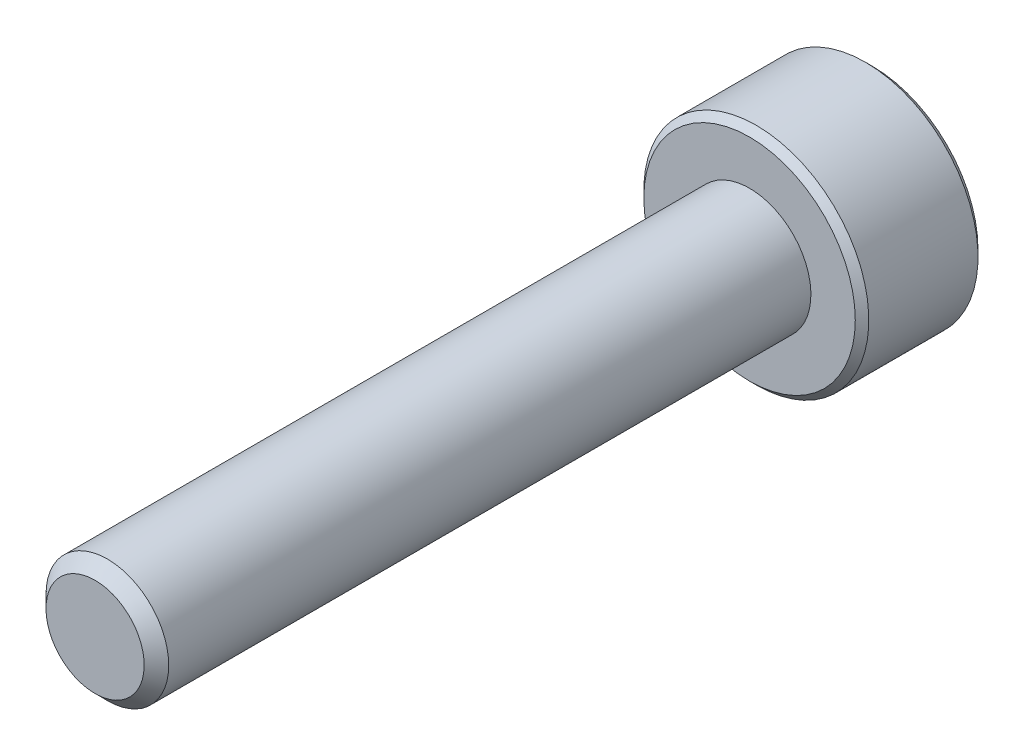
ISO-10303-21;
HEADER;
FILE_DESCRIPTION(('STEP AP214'),'2;1');
FILE_NAME('part.step','',(''),(''),'','','');
FILE_SCHEMA(('AUTOMOTIVE_DESIGN { 1 0 10303 214 1 1 1 1 }'));
ENDSEC;
DATA;
#1=APPLICATION_CONTEXT('core data for automotive mechanical design processes');
#2=APPLICATION_PROTOCOL_DEFINITION('international standard','automotive_design',2000,#1);
#3=PRODUCT_CONTEXT('',#1,'mechanical');
#4=PRODUCT('Part','Part','',(#3));
#5=PRODUCT_RELATED_PRODUCT_CATEGORY('part','',(#4));
#6=PRODUCT_DEFINITION_FORMATION('','',#4);
#7=PRODUCT_DEFINITION_CONTEXT('part definition',#1,'design');
#8=PRODUCT_DEFINITION('design','',#6,#7);
#9=PRODUCT_DEFINITION_SHAPE('','',#8);
#10=(LENGTH_UNIT() NAMED_UNIT(*) SI_UNIT(.MILLI.,.METRE.));
#11=(NAMED_UNIT(*) PLANE_ANGLE_UNIT() SI_UNIT($,.RADIAN.));
#12=(NAMED_UNIT(*) SI_UNIT($,.STERADIAN.) SOLID_ANGLE_UNIT());
#13=UNCERTAINTY_MEASURE_WITH_UNIT(LENGTH_MEASURE(1.E-05),#10,'distance_accuracy_value','');
#14=(GEOMETRIC_REPRESENTATION_CONTEXT(3) GLOBAL_UNCERTAINTY_ASSIGNED_CONTEXT((#13)) GLOBAL_UNIT_ASSIGNED_CONTEXT((#10,
#11,#12)) REPRESENTATION_CONTEXT('',''));
#15=CARTESIAN_POINT('',(0.,0.,0.));
#16=DIRECTION('',(0.,0.,1.));
#17=DIRECTION('',(1.,0.,0.));
#18=AXIS2_PLACEMENT_3D('',#15,#16,#17);
#19=CARTESIAN_POINT('',(0.,0.,-3.));
#20=DIRECTION('',(0.,0.,1.));
#21=DIRECTION('',(0.,-1.,0.));
#22=AXIS2_PLACEMENT_3D('',#19,#20,#21);
#23=PLANE('',#22);
#24=CARTESIAN_POINT('',(0.,0.,-3.));
#25=DIRECTION('',(0.,0.,1.));
#26=DIRECTION('',(0.,-1.,0.));
#27=AXIS2_PLACEMENT_3D('',#24,#25,#26);
#28=CIRCLE('',#27,2.58499999999999);
#29=CARTESIAN_POINT('',(0.,-2.58499999999999,-3.));
#30=VERTEX_POINT('',#29);
#31=EDGE_CURVE('E175',#30,#30,#28,.F.);
#32=ORIENTED_EDGE('',*,*,#31,.T.);
#33=EDGE_LOOP('',(#32));
#34=FACE_BOUND('',#33,.T.);
#35=CARTESIAN_POINT('',(0.,0.,-3.));
#36=DIRECTION('',(0.,0.,-1.));
#37=DIRECTION('',(0.,1.,0.));
#38=AXIS2_PLACEMENT_3D('',#35,#36,#37);
#39=CIRCLE('',#38,1.44337567297406);
#40=CARTESIAN_POINT('',(0.,-1.44337567297406,-3.));
#41=VERTEX_POINT('',#40);
#42=CARTESIAN_POINT('',(-1.25,-0.721687836487032,-3.));
#43=VERTEX_POINT('',#42);
#44=EDGE_CURVE('E54',#41,#43,#39,.T.);
#45=ORIENTED_EDGE('',*,*,#44,.F.);
#46=CARTESIAN_POINT('',(1.25,-0.721687836487032,-3.));
#47=VERTEX_POINT('',#46);
#48=EDGE_CURVE('E131',#47,#41,#39,.T.);
#49=ORIENTED_EDGE('',*,*,#48,.F.);
#50=CARTESIAN_POINT('',(1.25,0.721687836487033,-3.));
#51=VERTEX_POINT('',#50);
#52=EDGE_CURVE('E126',#51,#47,#39,.T.);
#53=ORIENTED_EDGE('',*,*,#52,.F.);
#54=CARTESIAN_POINT('',(0.,1.44337567297406,-3.));
#55=VERTEX_POINT('',#54);
#56=EDGE_CURVE('E95',#55,#51,#39,.T.);
#57=ORIENTED_EDGE('',*,*,#56,.F.);
#58=CARTESIAN_POINT('',(-1.25,0.721687836487035,-3.));
#59=VERTEX_POINT('',#58);
#60=EDGE_CURVE('E86',#59,#55,#39,.T.);
#61=ORIENTED_EDGE('',*,*,#60,.F.);
#62=EDGE_CURVE('E47',#43,#59,#39,.T.);
#63=ORIENTED_EDGE('',*,*,#62,.F.);
#64=EDGE_LOOP('',(#45,#49,#53,#57,#61,#63));
#65=FACE_BOUND('',#64,.T.);
#66=ADVANCED_FACE('F33',(#34,#65),#23,.F.);
#67=CARTESIAN_POINT('',(0.,0.,16.));
#68=DIRECTION('',(0.,0.,1.));
#69=DIRECTION('',(0.,-1.,0.));
#70=AXIS2_PLACEMENT_3D('',#67,#68,#69);
#71=CYLINDRICAL_SURFACE('',#70,2.75);
#72=CARTESIAN_POINT('',(0.,0.,-0.164999999999998));
#73=DIRECTION('',(0.,0.,-1.));
#74=DIRECTION('',(0.,1.,0.));
#75=AXIS2_PLACEMENT_3D('',#72,#73,#74);
#76=CIRCLE('',#75,2.75);
#77=CARTESIAN_POINT('',(0.,2.75,-0.164999999999998));
#78=VERTEX_POINT('',#77);
#79=EDGE_CURVE('E172',#78,#78,#76,.T.);
#80=ORIENTED_EDGE('',*,*,#79,.T.);
#81=EDGE_LOOP('',(#80));
#82=FACE_BOUND('',#81,.T.);
#83=CARTESIAN_POINT('',(0.,0.,-2.83499999999999));
#84=DIRECTION('',(0.,0.,1.));
#85=DIRECTION('',(0.,-1.,0.));
#86=AXIS2_PLACEMENT_3D('',#83,#84,#85);
#87=CIRCLE('',#86,2.75);
#88=CARTESIAN_POINT('',(0.,-2.75,-2.83499999999999));
#89=VERTEX_POINT('',#88);
#90=EDGE_CURVE('E169',#89,#89,#87,.T.);
#91=ORIENTED_EDGE('',*,*,#90,.T.);
#92=EDGE_LOOP('',(#91));
#93=FACE_BOUND('',#92,.T.);
#94=ADVANCED_FACE('F192',(#82,#93),#71,.T.);
#95=CARTESIAN_POINT('',(0.,2.75,0.));
#96=DIRECTION('',(0.,0.,-1.));
#97=DIRECTION('',(0.,1.,0.));
#98=AXIS2_PLACEMENT_3D('',#95,#96,#97);
#99=PLANE('',#98);
#100=CARTESIAN_POINT('',(0.,0.,0.));
#101=DIRECTION('',(0.,0.,-1.));
#102=DIRECTION('',(0.,1.,0.));
#103=AXIS2_PLACEMENT_3D('',#100,#101,#102);
#104=CIRCLE('',#103,2.585);
#105=CARTESIAN_POINT('',(0.,2.585,0.));
#106=VERTEX_POINT('',#105);
#107=EDGE_CURVE('E104',#106,#106,#104,.F.);
#108=ORIENTED_EDGE('',*,*,#107,.T.);
#109=EDGE_LOOP('',(#108));
#110=FACE_BOUND('',#109,.T.);
#111=CARTESIAN_POINT('',(0.,0.,0.));
#112=DIRECTION('',(0.,0.,1.));
#113=DIRECTION('',(0.,-1.,0.));
#114=AXIS2_PLACEMENT_3D('',#111,#112,#113);
#115=CIRCLE('',#114,1.5);
#116=CARTESIAN_POINT('',(0.,-1.5,0.));
#117=VERTEX_POINT('',#116);
#118=EDGE_CURVE('E105',#117,#117,#115,.T.);
#119=ORIENTED_EDGE('',*,*,#118,.F.);
#120=EDGE_LOOP('',(#119));
#121=FACE_BOUND('',#120,.T.);
#122=ADVANCED_FACE('F198',(#110,#121),#99,.F.);
#123=CARTESIAN_POINT('',(0.,0.,16.));
#124=DIRECTION('',(0.,0.,1.));
#125=DIRECTION('',(0.,-1.,0.));
#126=AXIS2_PLACEMENT_3D('',#123,#124,#125);
#127=CYLINDRICAL_SURFACE('',#126,1.5);
#128=CARTESIAN_POINT('',(0.,0.,15.7));
#129=DIRECTION('',(0.,0.,-1.));
#130=DIRECTION('',(0.,1.,0.));
#131=AXIS2_PLACEMENT_3D('',#128,#129,#130);
#132=CIRCLE('',#131,1.5);
#133=CARTESIAN_POINT('',(0.,1.5,15.7));
#134=VERTEX_POINT('',#133);
#135=EDGE_CURVE('E11',#134,#134,#132,.T.);
#136=ORIENTED_EDGE('',*,*,#135,.T.);
#137=EDGE_LOOP('',(#136));
#138=FACE_BOUND('',#137,.T.);
#139=ORIENTED_EDGE('',*,*,#118,.T.);
#140=EDGE_LOOP('',(#139));
#141=FACE_BOUND('',#140,.T.);
#142=ADVANCED_FACE('F215',(#138,#141),#127,.T.);
#143=CARTESIAN_POINT('',(0.,1.5,16.));
#144=DIRECTION('',(0.,0.,-1.));
#145=DIRECTION('',(0.,1.,0.));
#146=AXIS2_PLACEMENT_3D('',#143,#144,#145);
#147=PLANE('',#146);
#148=CARTESIAN_POINT('',(0.,0.,16.));
#149=DIRECTION('',(0.,0.,-1.));
#150=DIRECTION('',(0.,1.,0.));
#151=AXIS2_PLACEMENT_3D('',#148,#149,#150);
#152=CIRCLE('',#151,1.2);
#153=CARTESIAN_POINT('',(0.,1.2,16.));
#154=VERTEX_POINT('',#153);
#155=EDGE_CURVE('E41',#154,#154,#152,.F.);
#156=ORIENTED_EDGE('',*,*,#155,.T.);
#157=EDGE_LOOP('',(#156));
#158=FACE_BOUND('',#157,.T.);
#159=ADVANCED_FACE('F180',(#158),#147,.F.);
#160=CARTESIAN_POINT('',(0.,0.,-3.));
#161=DIRECTION('',(0.,0.,-1.));
#162=DIRECTION('',(0.,1.,0.));
#163=AXIS2_PLACEMENT_3D('',#160,#161,#162);
#164=CONICAL_SURFACE('',#163,1.44337567297406,0.78539816339745);
#165=ORIENTED_EDGE('',*,*,#56,.T.);
#166=CARTESIAN_POINT('',(-0.000199999999999541,1.4434911430279,-3.00011548390913));
#167=CARTESIAN_POINT('',(0.042775167071587,1.41867941875065,-2.9753216680551));
#168=CARTESIAN_POINT('',(0.0864690047459483,1.39345276980743,-2.95198373441868));
#169=CARTESIAN_POINT('',(0.175565930841942,1.34201263554194,-2.90925200408454));
#170=CARTESIAN_POINT('',(0.220977498357064,1.31579425481276,-2.88988199236041));
#171=CARTESIAN_POINT('',(0.31254782093526,1.26292610442246,-2.85670048341348));
#172=CARTESIAN_POINT('',(0.358683240175886,1.23628980770471,-2.84280555905265));
#173=CARTESIAN_POINT('',(0.451970080407592,1.18243062538508,-2.82139728216064));
#174=CARTESIAN_POINT('',(0.499118649136379,1.15520938653761,-2.81386794156679));
#175=CARTESIAN_POINT('',(0.580373556887252,1.10829684367467,-2.8070744980507));
#176=CARTESIAN_POINT('',(0.61437487662794,1.08866617256958,-2.80606855910435));
#177=CARTESIAN_POINT('',(0.682317764432477,1.04943932800611,-2.80776141491132));
#178=CARTESIAN_POINT('',(0.716259317655657,1.02984316311599,-2.81046102721554));
#179=CARTESIAN_POINT('',(0.783814856457499,0.9908399546035,-2.81940893031638));
#180=CARTESIAN_POINT('',(0.817428507286774,0.971433104248771,-2.8256605258997));
#181=CARTESIAN_POINT('',(0.884094638217813,0.932943395609906,-2.8413756814139));
#182=CARTESIAN_POINT('',(0.917146871030295,0.913860680098301,-2.85084062008746));
#183=CARTESIAN_POINT('',(1.00179969160026,0.864986351354568,-2.87893139068758));
#184=CARTESIAN_POINT('',(1.05286649242964,0.835502920149076,-2.8996701574522));
#185=CARTESIAN_POINT('',(1.15300085411325,0.777690319475909,-2.94638713467147));
#186=CARTESIAN_POINT('',(1.20207431157827,0.749357745598417,-2.97234829594676));
#187=CARTESIAN_POINT('',(1.2502,0.721572366433195,-3.00011548390913));
#188=B_SPLINE_CURVE_WITH_KNOTS('',3,(#166,#167,#168,#169,#170,#171,#172,#173,#174,#175,#176,
#177,#178,#179,#180,#181,#182,#183,#184,#185,#186,#187),.UNSPECIFIED.,.F.,.F.,(4,2,2,2,2,2,2,2,
2,2,4),(0.,0.166533409618303,0.334037607289761,0.498880396489697,0.663307919240273,
0.780963963458826,0.898645970148452,1.01643764860773,1.13427993171549,1.32148652032141,
1.50809158792573),.UNSPECIFIED.);
#189=EDGE_CURVE('E99',#55,#51,#188,.T.);
#190=ORIENTED_EDGE('',*,*,#189,.F.);
#191=EDGE_LOOP('',(#165,#190));
#192=FACE_BOUND('',#191,.T.);
#193=ADVANCED_FACE('F100',(#192),#164,.F.);
#194=ORIENTED_EDGE('',*,*,#52,.T.);
#195=CARTESIAN_POINT('',(1.25,-1.43934010829019,-3.46298209705044));
#196=CARTESIAN_POINT('',(1.25,-1.40429313026013,-3.43652492278491));
#197=CARTESIAN_POINT('',(1.25,-1.36905087155364,-3.41032716050022));
#198=CARTESIAN_POINT('',(1.25,-1.29809650724891,-3.3585575719734));
#199=CARTESIAN_POINT('',(1.25,-1.2623842859448,-3.33298590448406));
#200=CARTESIAN_POINT('',(1.25,-1.1539011180887,-3.25700599379898));
#201=CARTESIAN_POINT('',(1.25,-1.08031646741187,-3.20774028628697));
#202=CARTESIAN_POINT('',(1.25,-0.926012322877302,-3.11102583033562));
#203=CARTESIAN_POINT('',(1.25,-0.845125318763648,-3.06384129900157));
#204=CARTESIAN_POINT('',(1.25,-0.679311174153443,-2.97753073442661));
#205=CARTESIAN_POINT('',(1.25,-0.594398891087583,-2.93837753465223));
#206=CARTESIAN_POINT('',(1.25,-0.466944812509639,-2.89047722370555));
#207=CARTESIAN_POINT('',(1.25,-0.426289985866744,-2.87672948980391));
#208=CARTESIAN_POINT('',(1.25,-0.343998850155402,-2.85249792746773));
#209=CARTESIAN_POINT('',(1.25,-0.302362473684286,-2.84201432388626));
#210=CARTESIAN_POINT('',(1.25,-0.219052696365195,-2.8250301617622));
#211=CARTESIAN_POINT('',(1.25,-0.177393428559044,-2.81846136048343));
#212=CARTESIAN_POINT('',(1.25,-0.0936293694345977,-2.80943505346499));
#213=CARTESIAN_POINT('',(1.25,-0.0515246559536486,-2.80697684100151));
#214=CARTESIAN_POINT('',(1.25,0.031189057522439,-2.80635406201072));
#215=CARTESIAN_POINT('',(1.25,0.0717969624376322,-2.80803711683992));
#216=CARTESIAN_POINT('',(1.25,0.152668636765093,-2.81526827058346));
#217=CARTESIAN_POINT('',(1.25,0.192932338711554,-2.8208171103943));
#218=CARTESIAN_POINT('',(1.25,0.273499879034189,-2.83557103643701));
#219=CARTESIAN_POINT('',(1.25,0.313792180483814,-2.84483817593136));
#220=CARTESIAN_POINT('',(1.25,0.393496413769926,-2.86653617841489));
#221=CARTESIAN_POINT('',(1.25,0.432908418970283,-2.87896677668328));
#222=CARTESIAN_POINT('',(1.25,0.556992735685997,-2.92277935286094));
#223=CARTESIAN_POINT('',(1.25,0.639898924463084,-2.95915107278417));
#224=CARTESIAN_POINT('',(1.25,0.801816555245348,-3.04001916204164));
#225=CARTESIAN_POINT('',(1.25,0.880812666046053,-3.08454472075164));
#226=CARTESIAN_POINT('',(1.25,1.03178561247421,-3.17640487646102));
#227=CARTESIAN_POINT('',(1.25,1.10391618450775,-3.22348993368923));
#228=CARTESIAN_POINT('',(1.25,1.2101860600607,-3.29627856133952));
#229=CARTESIAN_POINT('',(1.25,1.24515069931176,-3.32079808512376));
#230=CARTESIAN_POINT('',(1.25,1.31460220812614,-3.37048563647493));
#231=CARTESIAN_POINT('',(1.25,1.34908920555539,-3.3956534851142));
#232=CARTESIAN_POINT('',(1.25,1.38337731640878,-3.42109014852934));
#233=B_SPLINE_CURVE_WITH_KNOTS('',3,(#195,#196,#197,#198,#199,#200,#201,#202,#203,#204,#205,
#206,#207,#208,#209,#210,#211,#212,#213,#214,#215,#216,#217,#218,#219,#220,#221,#222,#223,#224,
#225,#226,#227,#228,#229,#230,#231,#232),.UNSPECIFIED.,.F.,.F.,(4,2,2,2,2,2,2,2,2,2,2,2,2,2,2,2,
2,2,4),(0.,0.131732960406522,0.263498984211801,0.529042014557081,0.809741926293178,
1.08947609738757,1.21811634292656,1.34676544802529,1.47310084535082,1.59941451989631,
1.72115042182424,1.84290966145034,1.96679153917269,2.09066305376595,2.36146692896707,
2.63325989189267,2.89154668194565,3.01965734485811,3.14773302219539),.UNSPECIFIED.);
#234=EDGE_CURVE('E127',#51,#47,#233,.F.);
#235=ORIENTED_EDGE('',*,*,#234,.F.);
#236=EDGE_LOOP('',(#194,#235));
#237=FACE_BOUND('',#236,.T.);
#238=ADVANCED_FACE('F281',(#237),#164,.F.);
#239=ORIENTED_EDGE('',*,*,#48,.T.);
#240=CARTESIAN_POINT('',(1.2502,-0.721572366433194,-3.00011548390913));
#241=CARTESIAN_POINT('',(1.20722483292841,-0.746384090710444,-2.9753216680551));
#242=CARTESIAN_POINT('',(1.16353099525405,-0.771610739653664,-2.95198373441868));
#243=CARTESIAN_POINT('',(1.07443406915806,-0.823050873919154,-2.90925200408454));
#244=CARTESIAN_POINT('',(1.02902250164294,-0.849269254648333,-2.88988199236041));
#245=CARTESIAN_POINT('',(0.93745217906474,-0.902137405038635,-2.85670048341348));
#246=CARTESIAN_POINT('',(0.891316759824114,-0.928773701756387,-2.84280555905265));
#247=CARTESIAN_POINT('',(0.798029919592407,-0.982632884076012,-2.82139728216064));
#248=CARTESIAN_POINT('',(0.75088135086362,-1.00985412292348,-2.81386794156679));
#249=CARTESIAN_POINT('',(0.669626443112748,-1.05676666578643,-2.8070744980507));
#250=CARTESIAN_POINT('',(0.635625123372059,-1.07639733689152,-2.80606855910435));
#251=CARTESIAN_POINT('',(0.567682235567522,-1.11562418145499,-2.80776141491132));
#252=CARTESIAN_POINT('',(0.533740682344342,-1.1352203463451,-2.81046102721554));
#253=CARTESIAN_POINT('',(0.4661851435425,-1.1742235548576,-2.81940893031638));
#254=CARTESIAN_POINT('',(0.432571492713225,-1.19363040521232,-2.8256605258997));
#255=CARTESIAN_POINT('',(0.365905361782187,-1.23212011385119,-2.8413756814139));
#256=CARTESIAN_POINT('',(0.332853128969704,-1.2512028293628,-2.85084062008746));
#257=CARTESIAN_POINT('',(0.248200308399735,-1.30007715810653,-2.87893139068758));
#258=CARTESIAN_POINT('',(0.197133507570362,-1.32956058931202,-2.8996701574522));
#259=CARTESIAN_POINT('',(0.0969991458867452,-1.38737318998519,-2.94638713467147));
#260=CARTESIAN_POINT('',(0.0479256884217306,-1.41570576386268,-2.97234829594676));
#261=CARTESIAN_POINT('',(-0.000199999999999969,-1.4434911430279,-3.00011548390913));
#262=B_SPLINE_CURVE_WITH_KNOTS('',3,(#240,#241,#242,#243,#244,#245,#246,#247,#248,#249,#250,
#251,#252,#253,#254,#255,#256,#257,#258,#259,#260,#261),.UNSPECIFIED.,.F.,.F.,(4,2,2,2,2,2,2,2,
2,2,4),(0.,0.166533409618304,0.334037607289762,0.498880396489698,0.663307919240274,
0.780963963458826,0.898645970148452,1.01643764860773,1.13427993171549,1.32148652032141,
1.50809158792573),.UNSPECIFIED.);
#263=EDGE_CURVE('E129',#47,#41,#262,.T.);
#264=ORIENTED_EDGE('',*,*,#263,.F.);
#265=EDGE_LOOP('',(#239,#264));
#266=FACE_BOUND('',#265,.T.);
#267=ADVANCED_FACE('F279',(#266),#164,.F.);
#268=ORIENTED_EDGE('',*,*,#44,.T.);
#269=CARTESIAN_POINT('',(0.000200000000000132,-1.4434911430279,-3.00011548390913));
#270=CARTESIAN_POINT('',(-0.0427751670715865,-1.41867941875065,-2.9753216680551));
#271=CARTESIAN_POINT('',(-0.0864690047459478,-1.39345276980743,-2.95198373441868));
#272=CARTESIAN_POINT('',(-0.175565930841941,-1.34201263554194,-2.90925200408454));
#273=CARTESIAN_POINT('',(-0.220977498357063,-1.31579425481276,-2.88988199236041));
#274=CARTESIAN_POINT('',(-0.312547820935259,-1.26292610442246,-2.85670048341348));
#275=CARTESIAN_POINT('',(-0.358683240175885,-1.23628980770471,-2.84280555905265));
#276=CARTESIAN_POINT('',(-0.451970080407592,-1.18243062538508,-2.82139728216064));
#277=CARTESIAN_POINT('',(-0.499118649136379,-1.15520938653761,-2.81386794156679));
#278=CARTESIAN_POINT('',(-0.580373556887252,-1.10829684367467,-2.8070744980507));
#279=CARTESIAN_POINT('',(-0.61437487662794,-1.08866617256958,-2.80606855910435));
#280=CARTESIAN_POINT('',(-0.682317764432477,-1.04943932800611,-2.80776141491132));
#281=CARTESIAN_POINT('',(-0.716259317655657,-1.02984316311599,-2.81046102721554));
#282=CARTESIAN_POINT('',(-0.783814856457499,-0.990839954603499,-2.81940893031638));
#283=CARTESIAN_POINT('',(-0.817428507286774,-0.971433104248771,-2.8256605258997));
#284=CARTESIAN_POINT('',(-0.884094638217812,-0.932943395609905,-2.8413756814139));
#285=CARTESIAN_POINT('',(-0.917146871030295,-0.9138606800983,-2.85084062008746));
#286=CARTESIAN_POINT('',(-1.00179969160026,-0.864986351354567,-2.87893139068758));
#287=CARTESIAN_POINT('',(-1.05286649242964,-0.835502920149076,-2.8996701574522));
#288=CARTESIAN_POINT('',(-1.15300085411325,-0.777690319475908,-2.94638713467147));
#289=CARTESIAN_POINT('',(-1.20207431157827,-0.749357745598417,-2.97234829594676));
#290=CARTESIAN_POINT('',(-1.2502,-0.721572366433194,-3.00011548390913));
#291=B_SPLINE_CURVE_WITH_KNOTS('',3,(#269,#270,#271,#272,#273,#274,#275,#276,#277,#278,#279,
#280,#281,#282,#283,#284,#285,#286,#287,#288,#289,#290),.UNSPECIFIED.,.F.,.F.,(4,2,2,2,2,2,2,2,
2,2,4),(0.,0.166533409618303,0.334037607289761,0.498880396489698,0.663307919240274,
0.780963963458826,0.898645970148452,1.01643764860773,1.13427993171549,1.32148652032141,
1.50809158792573),.UNSPECIFIED.);
#292=EDGE_CURVE('E249',#41,#43,#291,.T.);
#293=ORIENTED_EDGE('',*,*,#292,.F.);
#294=EDGE_LOOP('',(#268,#293));
#295=FACE_BOUND('',#294,.T.);
#296=ADVANCED_FACE('F278',(#295),#164,.F.);
#297=ORIENTED_EDGE('',*,*,#62,.T.);
#298=CARTESIAN_POINT('',(-1.25,-1.43934010829019,-3.46298209705044));
#299=CARTESIAN_POINT('',(-1.25,-1.40429313026013,-3.43652492278491));
#300=CARTESIAN_POINT('',(-1.25,-1.36905087155364,-3.41032716050022));
#301=CARTESIAN_POINT('',(-1.25,-1.29809650724891,-3.3585575719734));
#302=CARTESIAN_POINT('',(-1.25,-1.2623842859448,-3.33298590448407));
#303=CARTESIAN_POINT('',(-1.25,-1.1539011180887,-3.25700599379899));
#304=CARTESIAN_POINT('',(-1.25,-1.08031646741188,-3.20774028628697));
#305=CARTESIAN_POINT('',(-1.25,-0.926012322877304,-3.11102583033562));
#306=CARTESIAN_POINT('',(-1.25,-0.84512531876365,-3.06384129900157));
#307=CARTESIAN_POINT('',(-1.25,-0.679311174153445,-2.97753073442661));
#308=CARTESIAN_POINT('',(-1.25,-0.594398891087584,-2.93837753465223));
#309=CARTESIAN_POINT('',(-1.25,-0.46694481250964,-2.89047722370555));
#310=CARTESIAN_POINT('',(-1.25,-0.426289985866745,-2.87672948980391));
#311=CARTESIAN_POINT('',(-1.25,-0.343998850155403,-2.85249792746773));
#312=CARTESIAN_POINT('',(-1.25,-0.302362473684286,-2.84201432388626));
#313=CARTESIAN_POINT('',(-1.25,-0.219052696365195,-2.8250301617622));
#314=CARTESIAN_POINT('',(-1.25,-0.177393428559044,-2.81846136048342));
#315=CARTESIAN_POINT('',(-1.25,-0.093629369434598,-2.80943505346499));
#316=CARTESIAN_POINT('',(-1.25,-0.0515246559536487,-2.80697684100151));
#317=CARTESIAN_POINT('',(-1.25,0.0311890575224389,-2.80635406201072));
#318=CARTESIAN_POINT('',(-1.25,0.0717969624376321,-2.80803711683992));
#319=CARTESIAN_POINT('',(-1.25,0.152668636765093,-2.81526827058346));
#320=CARTESIAN_POINT('',(-1.25,0.192932338711554,-2.82081711039429));
#321=CARTESIAN_POINT('',(-1.25,0.273499879034189,-2.83557103643701));
#322=CARTESIAN_POINT('',(-1.25,0.313792180483814,-2.84483817593136));
#323=CARTESIAN_POINT('',(-1.25,0.393496413769926,-2.86653617841489));
#324=CARTESIAN_POINT('',(-1.25,0.432908418970283,-2.87896677668328));
#325=CARTESIAN_POINT('',(-1.25,0.556992735685997,-2.92277935286094));
#326=CARTESIAN_POINT('',(-1.25,0.639898924463084,-2.95915107278417));
#327=CARTESIAN_POINT('',(-1.25,0.801816555245348,-3.04001916204163));
#328=CARTESIAN_POINT('',(-1.25,0.880812666046053,-3.08454472075164));
#329=CARTESIAN_POINT('',(-1.25,1.03178561247421,-3.17640487646102));
#330=CARTESIAN_POINT('',(-1.25,1.10391618450775,-3.22348993368923));
#331=CARTESIAN_POINT('',(-1.25,1.2101860600607,-3.29627856133952));
#332=CARTESIAN_POINT('',(-1.25,1.24515069931176,-3.32079808512376));
#333=CARTESIAN_POINT('',(-1.25,1.31460220812614,-3.37048563647493));
#334=CARTESIAN_POINT('',(-1.25,1.34908920555539,-3.3956534851142));
#335=CARTESIAN_POINT('',(-1.25,1.38337731640878,-3.42109014852934));
#336=B_SPLINE_CURVE_WITH_KNOTS('',3,(#298,#299,#300,#301,#302,#303,#304,#305,#306,#307,#308,
#309,#310,#311,#312,#313,#314,#315,#316,#317,#318,#319,#320,#321,#322,#323,#324,#325,#326,#327,
#328,#329,#330,#331,#332,#333,#334,#335),.UNSPECIFIED.,.F.,.F.,(4,2,2,2,2,2,2,2,2,2,2,2,2,2,2,2,
2,2,4),(0.,0.131732960406522,0.2634989842118,0.529042014557081,0.809741926293178,
1.08947609738757,1.21811634292656,1.3467654480253,1.47310084535082,1.59941451989631,
1.72115042182424,1.84290966145034,1.96679153917269,2.09066305376595,2.36146692896708,
2.63325989189267,2.89154668194565,3.01965734485811,3.1477330221954),.UNSPECIFIED.);
#337=EDGE_CURVE('E115',#43,#59,#336,.T.);
#338=ORIENTED_EDGE('',*,*,#337,.F.);
#339=EDGE_LOOP('',(#297,#338));
#340=FACE_BOUND('',#339,.T.);
#341=ADVANCED_FACE('F286',(#340),#164,.F.);
#342=ORIENTED_EDGE('',*,*,#60,.T.);
#343=CARTESIAN_POINT('',(-1.2502,0.721572366433195,-3.00011548390913));
#344=CARTESIAN_POINT('',(-1.20722483292841,0.746384090710445,-2.9753216680551));
#345=CARTESIAN_POINT('',(-1.16353099525405,0.771610739653665,-2.95198373441868));
#346=CARTESIAN_POINT('',(-1.07443406915806,0.823050873919155,-2.90925200408453));
#347=CARTESIAN_POINT('',(-1.02902250164294,0.849269254648334,-2.88988199236041));
#348=CARTESIAN_POINT('',(-0.937452179064739,0.902137405038636,-2.85670048341348));
#349=CARTESIAN_POINT('',(-0.891316759824114,0.928773701756387,-2.84280555905265));
#350=CARTESIAN_POINT('',(-0.798029919592407,0.982632884076013,-2.82139728216064));
#351=CARTESIAN_POINT('',(-0.75088135086362,1.00985412292348,-2.81386794156679));
#352=CARTESIAN_POINT('',(-0.669626443112747,1.05676666578643,-2.8070744980507));
#353=CARTESIAN_POINT('',(-0.635625123372059,1.07639733689152,-2.80606855910435));
#354=CARTESIAN_POINT('',(-0.567682235567522,1.11562418145499,-2.80776141491132));
#355=CARTESIAN_POINT('',(-0.533740682344342,1.1352203463451,-2.81046102721554));
#356=CARTESIAN_POINT('',(-0.4661851435425,1.1742235548576,-2.81940893031638));
#357=CARTESIAN_POINT('',(-0.432571492713225,1.19363040521233,-2.8256605258997));
#358=CARTESIAN_POINT('',(-0.365905361782187,1.23212011385119,-2.8413756814139));
#359=CARTESIAN_POINT('',(-0.332853128969704,1.2512028293628,-2.85084062008746));
#360=CARTESIAN_POINT('',(-0.248200308399736,1.30007715810653,-2.87893139068758));
#361=CARTESIAN_POINT('',(-0.197133507570362,1.32956058931202,-2.8996701574522));
#362=CARTESIAN_POINT('',(-0.096999145886745,1.38737318998519,-2.94638713467147));
#363=CARTESIAN_POINT('',(-0.0479256884217302,1.41570576386268,-2.97234829594677));
#364=CARTESIAN_POINT('',(0.00020000000000052,1.4434911430279,-3.00011548390913));
#365=B_SPLINE_CURVE_WITH_KNOTS('',3,(#343,#344,#345,#346,#347,#348,#349,#350,#351,#352,#353,
#354,#355,#356,#357,#358,#359,#360,#361,#362,#363,#364),.UNSPECIFIED.,.F.,.F.,(4,2,2,2,2,2,2,2,
2,2,4),(0.,0.166533409618303,0.334037607289761,0.498880396489697,0.663307919240273,
0.780963963458825,0.898645970148451,1.01643764860773,1.13427993171549,1.32148652032141,
1.50809158792573),.UNSPECIFIED.);
#366=EDGE_CURVE('E90',#59,#55,#365,.T.);
#367=ORIENTED_EDGE('',*,*,#366,.F.);
#368=EDGE_LOOP('',(#342,#367));
#369=FACE_BOUND('',#368,.T.);
#370=ADVANCED_FACE('F88',(#369),#164,.F.);
#371=CARTESIAN_POINT('',(1.25,2.1650635094611,-1.125));
#372=DIRECTION('',(0.,0.,-1.));
#373=DIRECTION('',(-1.,0.,0.));
#374=AXIS2_PLACEMENT_3D('',#371,#372,#373);
#375=PLANE('',#374);
#376=DIRECTION('',(0.866025403784439,0.5,0.));
#377=VECTOR('',#376,1.);
#378=CARTESIAN_POINT('',(-1.25,0.721687836487033,-1.125));
#379=LINE('',#378,#377);
#380=CARTESIAN_POINT('',(-1.25,0.721687836487033,-1.125));
#381=VERTEX_POINT('',#380);
#382=CARTESIAN_POINT('',(0.,1.44337567297406,-1.125));
#383=VERTEX_POINT('',#382);
#384=EDGE_CURVE('E114',#381,#383,#379,.T.);
#385=ORIENTED_EDGE('',*,*,#384,.T.);
#386=DIRECTION('',(0.866025403784439,-0.5,0.));
#387=VECTOR('',#386,1.);
#388=CARTESIAN_POINT('',(0.,1.44337567297406,-1.125));
#389=LINE('',#388,#387);
#390=CARTESIAN_POINT('',(1.25,0.721687836487033,-1.125));
#391=VERTEX_POINT('',#390);
#392=EDGE_CURVE('E119',#383,#391,#389,.T.);
#393=ORIENTED_EDGE('',*,*,#392,.T.);
#394=DIRECTION('',(0.,-1.,0.));
#395=VECTOR('',#394,1.);
#396=CARTESIAN_POINT('',(1.25,0.721687836487033,-1.125));
#397=LINE('',#396,#395);
#398=CARTESIAN_POINT('',(1.25,-0.721687836487032,-1.125));
#399=VERTEX_POINT('',#398);
#400=EDGE_CURVE('E233',#391,#399,#397,.T.);
#401=ORIENTED_EDGE('',*,*,#400,.T.);
#402=DIRECTION('',(-0.866025403784439,-0.5,0.));
#403=VECTOR('',#402,1.);
#404=CARTESIAN_POINT('',(1.25,-0.721687836487032,-1.125));
#405=LINE('',#404,#403);
#406=CARTESIAN_POINT('',(0.,-1.44337567297406,-1.125));
#407=VERTEX_POINT('',#406);
#408=EDGE_CURVE('E237',#399,#407,#405,.T.);
#409=ORIENTED_EDGE('',*,*,#408,.T.);
#410=DIRECTION('',(-0.866025403784439,0.5,0.));
#411=VECTOR('',#410,1.);
#412=CARTESIAN_POINT('',(0.,-1.44337567297406,-1.125));
#413=LINE('',#412,#411);
#414=CARTESIAN_POINT('',(-1.25,-0.721687836487032,-1.125));
#415=VERTEX_POINT('',#414);
#416=EDGE_CURVE('E243',#407,#415,#413,.T.);
#417=ORIENTED_EDGE('',*,*,#416,.T.);
#418=DIRECTION('',(0.,1.,0.));
#419=VECTOR('',#418,1.);
#420=CARTESIAN_POINT('',(-1.25,-0.721687836487032,-1.125));
#421=LINE('',#420,#419);
#422=EDGE_CURVE('E122',#415,#381,#421,.T.);
#423=ORIENTED_EDGE('',*,*,#422,.T.);
#424=EDGE_LOOP('',(#385,#393,#401,#409,#417,#423));
#425=FACE_BOUND('',#424,.T.);
#426=ADVANCED_FACE('F158',(#425),#375,.T.);
#427=CARTESIAN_POINT('',(0.,1.44337567297406,-1.125));
#428=DIRECTION('',(0.5,0.866025403784439,0.));
#429=DIRECTION('',(-0.866025403784439,0.5,0.));
#430=AXIS2_PLACEMENT_3D('',#427,#428,#429);
#431=PLANE('',#430);
#432=DIRECTION('',(0.,0.,-1.));
#433=VECTOR('',#432,1.);
#434=CARTESIAN_POINT('',(0.,1.44337567297406,-1.125));
#435=LINE('',#434,#433);
#436=EDGE_CURVE('E111',#383,#55,#435,.T.);
#437=ORIENTED_EDGE('',*,*,#436,.T.);
#438=ORIENTED_EDGE('',*,*,#189,.T.);
#439=DIRECTION('',(0.,0.,-1.));
#440=VECTOR('',#439,1.);
#441=CARTESIAN_POINT('',(1.25,0.721687836487033,-1.125));
#442=LINE('',#441,#440);
#443=EDGE_CURVE('E121',#391,#51,#442,.T.);
#444=ORIENTED_EDGE('',*,*,#443,.F.);
#445=ORIENTED_EDGE('',*,*,#392,.F.);
#446=EDGE_LOOP('',(#437,#438,#444,#445));
#447=FACE_BOUND('',#446,.T.);
#448=ADVANCED_FACE('F117',(#447),#431,.F.);
#449=CARTESIAN_POINT('',(1.25,0.721687836487033,-1.125));
#450=DIRECTION('',(1.,0.,0.));
#451=DIRECTION('',(0.,1.,0.));
#452=AXIS2_PLACEMENT_3D('',#449,#450,#451);
#453=PLANE('',#452);
#454=ORIENTED_EDGE('',*,*,#443,.T.);
#455=ORIENTED_EDGE('',*,*,#234,.T.);
#456=DIRECTION('',(0.,0.,-1.));
#457=VECTOR('',#456,1.);
#458=CARTESIAN_POINT('',(1.25,-0.721687836487032,-1.125));
#459=LINE('',#458,#457);
#460=EDGE_CURVE('E228',#399,#47,#459,.T.);
#461=ORIENTED_EDGE('',*,*,#460,.F.);
#462=ORIENTED_EDGE('',*,*,#400,.F.);
#463=EDGE_LOOP('',(#454,#455,#461,#462));
#464=FACE_BOUND('',#463,.T.);
#465=ADVANCED_FACE('F147',(#464),#453,.F.);
#466=CARTESIAN_POINT('',(1.25,-0.721687836487032,-1.125));
#467=DIRECTION('',(0.5,-0.866025403784439,0.));
#468=DIRECTION('',(0.866025403784439,0.5,0.));
#469=AXIS2_PLACEMENT_3D('',#466,#467,#468);
#470=PLANE('',#469);
#471=ORIENTED_EDGE('',*,*,#460,.T.);
#472=ORIENTED_EDGE('',*,*,#263,.T.);
#473=DIRECTION('',(0.,0.,-1.));
#474=VECTOR('',#473,1.);
#475=CARTESIAN_POINT('',(0.,-1.44337567297406,-1.125));
#476=LINE('',#475,#474);
#477=EDGE_CURVE('E222',#407,#41,#476,.T.);
#478=ORIENTED_EDGE('',*,*,#477,.F.);
#479=ORIENTED_EDGE('',*,*,#408,.F.);
#480=EDGE_LOOP('',(#471,#472,#478,#479));
#481=FACE_BOUND('',#480,.T.);
#482=ADVANCED_FACE('F151',(#481),#470,.F.);
#483=CARTESIAN_POINT('',(0.,-1.44337567297406,-1.125));
#484=DIRECTION('',(-0.5,-0.866025403784439,0.));
#485=DIRECTION('',(0.866025403784439,-0.5,0.));
#486=AXIS2_PLACEMENT_3D('',#483,#484,#485);
#487=PLANE('',#486);
#488=ORIENTED_EDGE('',*,*,#477,.T.);
#489=ORIENTED_EDGE('',*,*,#292,.T.);
#490=DIRECTION('',(0.,0.,-1.));
#491=VECTOR('',#490,1.);
#492=CARTESIAN_POINT('',(-1.25,-0.721687836487032,-1.125));
#493=LINE('',#492,#491);
#494=EDGE_CURVE('E219',#415,#43,#493,.T.);
#495=ORIENTED_EDGE('',*,*,#494,.F.);
#496=ORIENTED_EDGE('',*,*,#416,.F.);
#497=EDGE_LOOP('',(#488,#489,#495,#496));
#498=FACE_BOUND('',#497,.T.);
#499=ADVANCED_FACE('F266',(#498),#487,.F.);
#500=CARTESIAN_POINT('',(-1.25,-0.721687836487032,-1.125));
#501=DIRECTION('',(-1.,0.,0.));
#502=DIRECTION('',(0.,-1.,0.));
#503=AXIS2_PLACEMENT_3D('',#500,#501,#502);
#504=PLANE('',#503);
#505=ORIENTED_EDGE('',*,*,#494,.T.);
#506=ORIENTED_EDGE('',*,*,#337,.T.);
#507=DIRECTION('',(0.,0.,-1.));
#508=VECTOR('',#507,1.);
#509=CARTESIAN_POINT('',(-1.25,0.721687836487033,-1.125));
#510=LINE('',#509,#508);
#511=EDGE_CURVE('E113',#381,#59,#510,.T.);
#512=ORIENTED_EDGE('',*,*,#511,.F.);
#513=ORIENTED_EDGE('',*,*,#422,.F.);
#514=EDGE_LOOP('',(#505,#506,#512,#513));
#515=FACE_BOUND('',#514,.T.);
#516=ADVANCED_FACE('F208',(#515),#504,.F.);
#517=CARTESIAN_POINT('',(-1.25,0.721687836487033,-1.125));
#518=DIRECTION('',(-0.5,0.866025403784439,0.));
#519=DIRECTION('',(-0.866025403784439,-0.5,0.));
#520=AXIS2_PLACEMENT_3D('',#517,#518,#519);
#521=PLANE('',#520);
#522=ORIENTED_EDGE('',*,*,#511,.T.);
#523=ORIENTED_EDGE('',*,*,#366,.T.);
#524=ORIENTED_EDGE('',*,*,#436,.F.);
#525=ORIENTED_EDGE('',*,*,#384,.F.);
#526=EDGE_LOOP('',(#522,#523,#524,#525));
#527=FACE_BOUND('',#526,.T.);
#528=ADVANCED_FACE('F109',(#527),#521,.F.);
#529=CARTESIAN_POINT('',(0.,0.,0.));
#530=DIRECTION('',(0.,0.,-1.));
#531=DIRECTION('',(0.,1.,0.));
#532=AXIS2_PLACEMENT_3D('',#529,#530,#531);
#533=CONICAL_SURFACE('',#532,2.585,0.785398163397457);
#534=ORIENTED_EDGE('',*,*,#79,.F.);
#535=EDGE_LOOP('',(#534));
#536=FACE_BOUND('',#535,.T.);
#537=ORIENTED_EDGE('',*,*,#107,.F.);
#538=EDGE_LOOP('',(#537));
#539=FACE_BOUND('',#538,.T.);
#540=ADVANCED_FACE('F188',(#536,#539),#533,.T.);
#541=CARTESIAN_POINT('',(0.,0.,-2.83499999999999));
#542=DIRECTION('',(0.,0.,1.));
#543=DIRECTION('',(0.,-1.,0.));
#544=AXIS2_PLACEMENT_3D('',#541,#542,#543);
#545=CONICAL_SURFACE('',#544,2.75,0.785398163397448);
#546=ORIENTED_EDGE('',*,*,#31,.F.);
#547=EDGE_LOOP('',(#546));
#548=FACE_BOUND('',#547,.T.);
#549=ORIENTED_EDGE('',*,*,#90,.F.);
#550=EDGE_LOOP('',(#549));
#551=FACE_BOUND('',#550,.T.);
#552=ADVANCED_FACE('F183',(#548,#551),#545,.T.);
#553=CARTESIAN_POINT('',(0.,0.,16.));
#554=DIRECTION('',(0.,0.,-1.));
#555=DIRECTION('',(0.,1.,0.));
#556=AXIS2_PLACEMENT_3D('',#553,#554,#555);
#557=CONICAL_SURFACE('',#556,1.2,0.785398163397444);
#558=ORIENTED_EDGE('',*,*,#135,.F.);
#559=EDGE_LOOP('',(#558));
#560=FACE_BOUND('',#559,.T.);
#561=ORIENTED_EDGE('',*,*,#155,.F.);
#562=EDGE_LOOP('',(#561));
#563=FACE_BOUND('',#562,.T.);
#564=ADVANCED_FACE('F35',(#560,#563),#557,.T.);
#565=CLOSED_SHELL('',(#66,#94,#122,#142,#159,#193,#238,#267,#296,#341,#370,#426,#448,#465,#482,
#499,#516,#528,#540,#552,#564));
#566=MANIFOLD_SOLID_BREP('B2',#565);
#567=ADVANCED_BREP_SHAPE_REPRESENTATION('',(#18,#566),#14);
#568=SHAPE_DEFINITION_REPRESENTATION(#9,#567);
ENDSEC;
END-ISO-10303-21;
